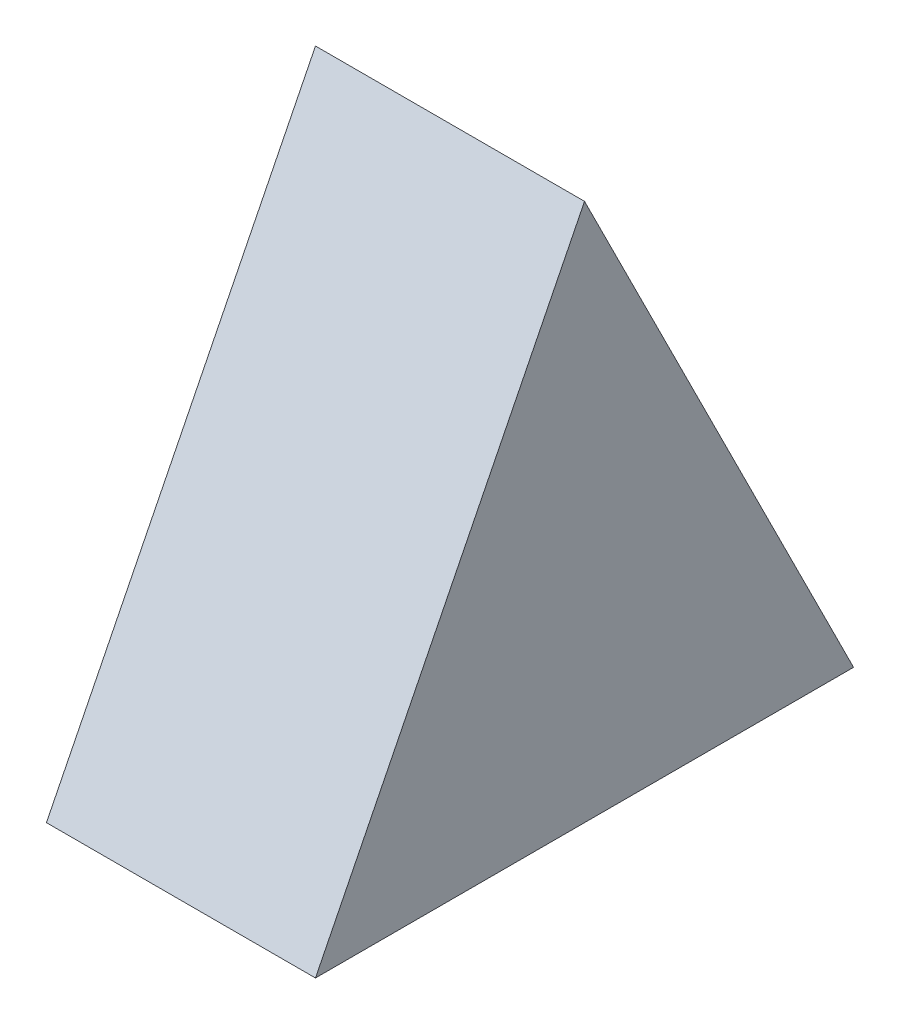
ISO-10303-21;
HEADER;
FILE_DESCRIPTION(('STEP AP214'),'2;1');
FILE_NAME('part.step','',(''),(''),'','','');
FILE_SCHEMA(('AUTOMOTIVE_DESIGN { 1 0 10303 214 1 1 1 1 }'));
ENDSEC;
DATA;
#1=APPLICATION_CONTEXT('core data for automotive mechanical design processes');
#2=APPLICATION_PROTOCOL_DEFINITION('international standard','automotive_design',2000,#1);
#3=PRODUCT_CONTEXT('',#1,'mechanical');
#4=PRODUCT('Part','Part','',(#3));
#5=PRODUCT_RELATED_PRODUCT_CATEGORY('part','',(#4));
#6=PRODUCT_DEFINITION_FORMATION('','',#4);
#7=PRODUCT_DEFINITION_CONTEXT('part definition',#1,'design');
#8=PRODUCT_DEFINITION('design','',#6,#7);
#9=PRODUCT_DEFINITION_SHAPE('','',#8);
#10=(LENGTH_UNIT() NAMED_UNIT(*) SI_UNIT(.MILLI.,.METRE.));
#11=(NAMED_UNIT(*) PLANE_ANGLE_UNIT() SI_UNIT($,.RADIAN.));
#12=(NAMED_UNIT(*) SI_UNIT($,.STERADIAN.) SOLID_ANGLE_UNIT());
#13=UNCERTAINTY_MEASURE_WITH_UNIT(LENGTH_MEASURE(1.E-05),#10,'distance_accuracy_value','');
#14=(GEOMETRIC_REPRESENTATION_CONTEXT(3) GLOBAL_UNCERTAINTY_ASSIGNED_CONTEXT((#13)) GLOBAL_UNIT_ASSIGNED_CONTEXT((#10,
#11,#12)) REPRESENTATION_CONTEXT('',''));
#15=CARTESIAN_POINT('',(0.,0.,0.));
#16=DIRECTION('',(0.,0.,1.));
#17=DIRECTION('',(1.,0.,0.));
#18=AXIS2_PLACEMENT_3D('',#15,#16,#17);
#19=CARTESIAN_POINT('',(0.,0.,40.));
#20=DIRECTION('',(0.,1.,0.));
#21=DIRECTION('',(0.,0.,1.));
#22=AXIS2_PLACEMENT_3D('',#19,#20,#21);
#23=PLANE('',#22);
#24=DIRECTION('',(1.,0.,0.));
#25=VECTOR('',#24,1.);
#26=CARTESIAN_POINT('',(0.,0.,40.));
#27=LINE('',#26,#25);
#28=CARTESIAN_POINT('',(20.,0.,40.));
#29=VERTEX_POINT('',#28);
#30=CARTESIAN_POINT('',(40.,0.,40.));
#31=VERTEX_POINT('',#30);
#32=EDGE_CURVE('E70',#29,#31,#27,.T.);
#33=ORIENTED_EDGE('',*,*,#32,.F.);
#34=DIRECTION('',(0.,0.,1.));
#35=VECTOR('',#34,1.);
#36=CARTESIAN_POINT('',(20.,0.,20.));
#37=LINE('',#36,#35);
#38=CARTESIAN_POINT('',(20.,0.,20.));
#39=VERTEX_POINT('',#38);
#40=EDGE_CURVE('E81',#39,#29,#37,.T.);
#41=ORIENTED_EDGE('',*,*,#40,.F.);
#42=DIRECTION('',(0.707106781186548,0.,0.707106781186548));
#43=VECTOR('',#42,1.);
#44=CARTESIAN_POINT('',(0.,0.,0.));
#45=LINE('',#44,#43);
#46=CARTESIAN_POINT('',(0.,0.,0.));
#47=VERTEX_POINT('',#46);
#48=EDGE_CURVE('E77',#47,#39,#45,.T.);
#49=ORIENTED_EDGE('',*,*,#48,.F.);
#50=DIRECTION('',(1.,0.,0.));
#51=VECTOR('',#50,1.);
#52=CARTESIAN_POINT('',(0.,0.,0.));
#53=LINE('',#52,#51);
#54=CARTESIAN_POINT('',(40.,0.,0.));
#55=VERTEX_POINT('',#54);
#56=EDGE_CURVE('E62',#47,#55,#53,.T.);
#57=ORIENTED_EDGE('',*,*,#56,.T.);
#58=DIRECTION('',(0.,0.,-1.));
#59=VECTOR('',#58,1.);
#60=CARTESIAN_POINT('',(40.,0.,40.));
#61=LINE('',#60,#59);
#62=EDGE_CURVE('E41',#31,#55,#61,.T.);
#63=ORIENTED_EDGE('',*,*,#62,.F.);
#64=EDGE_LOOP('',(#33,#41,#49,#57,#63));
#65=FACE_BOUND('',#64,.T.);
#66=ADVANCED_FACE('F33',(#65),#23,.F.);
#67=CARTESIAN_POINT('',(40.,0.,40.));
#68=DIRECTION('',(-1.,0.,0.));
#69=DIRECTION('',(0.,0.,1.));
#70=AXIS2_PLACEMENT_3D('',#67,#68,#69);
#71=PLANE('',#70);
#72=ORIENTED_EDGE('',*,*,#62,.T.);
#73=DIRECTION('',(0.,0.894427190999916,0.447213595499958));
#74=VECTOR('',#73,1.);
#75=CARTESIAN_POINT('',(40.,0.,0.));
#76=LINE('',#75,#74);
#77=CARTESIAN_POINT('',(40.,40.,20.));
#78=VERTEX_POINT('',#77);
#79=EDGE_CURVE('E65',#55,#78,#76,.T.);
#80=ORIENTED_EDGE('',*,*,#79,.T.);
#81=DIRECTION('',(0.,-0.894427190999916,0.447213595499958));
#82=VECTOR('',#81,1.);
#83=CARTESIAN_POINT('',(40.,0.,40.));
#84=LINE('',#83,#82);
#85=EDGE_CURVE('E82',#78,#31,#84,.T.);
#86=ORIENTED_EDGE('',*,*,#85,.T.);
#87=EDGE_LOOP('',(#72,#80,#86));
#88=FACE_BOUND('',#87,.T.);
#89=ADVANCED_FACE('F92',(#88),#71,.F.);
#90=CARTESIAN_POINT('',(0.,40.,0.));
#91=DIRECTION('',(0.707106781186548,0.,-0.707106781186548));
#92=DIRECTION('',(-0.707106781186548,0.,-0.707106781186548));
#93=AXIS2_PLACEMENT_3D('',#90,#91,#92);
#94=PLANE('',#93);
#95=ORIENTED_EDGE('',*,*,#48,.T.);
#96=DIRECTION('',(0.,-1.,0.));
#97=VECTOR('',#96,1.);
#98=CARTESIAN_POINT('',(20.,40.,20.));
#99=LINE('',#98,#97);
#100=CARTESIAN_POINT('',(20.,40.,20.));
#101=VERTEX_POINT('',#100);
#102=EDGE_CURVE('E71',#101,#39,#99,.T.);
#103=ORIENTED_EDGE('',*,*,#102,.F.);
#104=DIRECTION('',(0.408248290463863,0.816496580927726,0.408248290463863));
#105=VECTOR('',#104,1.);
#106=CARTESIAN_POINT('',(0.,0.,0.));
#107=LINE('',#106,#105);
#108=EDGE_CURVE('E11',#47,#101,#107,.T.);
#109=ORIENTED_EDGE('',*,*,#108,.F.);
#110=EDGE_LOOP('',(#95,#103,#109));
#111=FACE_BOUND('',#110,.T.);
#112=ADVANCED_FACE('F76',(#111),#94,.F.);
#113=CARTESIAN_POINT('',(20.,40.,20.));
#114=DIRECTION('',(1.,0.,0.));
#115=DIRECTION('',(0.,0.,-1.));
#116=AXIS2_PLACEMENT_3D('',#113,#114,#115);
#117=PLANE('',#116);
#118=ORIENTED_EDGE('',*,*,#40,.T.);
#119=DIRECTION('',(0.,-0.894427190999916,0.447213595499958));
#120=VECTOR('',#119,1.);
#121=CARTESIAN_POINT('',(20.,40.,20.));
#122=LINE('',#121,#120);
#123=EDGE_CURVE('E97',#101,#29,#122,.T.);
#124=ORIENTED_EDGE('',*,*,#123,.F.);
#125=ORIENTED_EDGE('',*,*,#102,.T.);
#126=EDGE_LOOP('',(#118,#124,#125));
#127=FACE_BOUND('',#126,.T.);
#128=ADVANCED_FACE('F100',(#127),#117,.F.);
#129=CARTESIAN_POINT('',(60.,40.,20.));
#130=DIRECTION('',(0.,-0.447213595499958,-0.894427190999916));
#131=DIRECTION('',(0.,0.894427190999916,-0.447213595499958));
#132=AXIS2_PLACEMENT_3D('',#129,#130,#131);
#133=PLANE('',#132);
#134=DIRECTION('',(-1.,0.,0.));
#135=VECTOR('',#134,1.);
#136=CARTESIAN_POINT('',(60.,40.,20.));
#137=LINE('',#136,#135);
#138=EDGE_CURVE('E86',#78,#101,#137,.T.);
#139=ORIENTED_EDGE('',*,*,#138,.T.);
#140=ORIENTED_EDGE('',*,*,#123,.T.);
#141=ORIENTED_EDGE('',*,*,#32,.T.);
#142=ORIENTED_EDGE('',*,*,#85,.F.);
#143=EDGE_LOOP('',(#139,#140,#141,#142));
#144=FACE_BOUND('',#143,.T.);
#145=ADVANCED_FACE('F95',(#144),#133,.F.);
#146=CARTESIAN_POINT('',(0.,0.,0.));
#147=DIRECTION('',(0.,-0.447213595499958,0.894427190999916));
#148=DIRECTION('',(0.,-0.894427190999916,-0.447213595499958));
#149=AXIS2_PLACEMENT_3D('',#146,#147,#148);
#150=PLANE('',#149);
#151=ORIENTED_EDGE('',*,*,#108,.T.);
#152=ORIENTED_EDGE('',*,*,#138,.F.);
#153=ORIENTED_EDGE('',*,*,#79,.F.);
#154=ORIENTED_EDGE('',*,*,#56,.F.);
#155=EDGE_LOOP('',(#151,#152,#153,#154));
#156=FACE_BOUND('',#155,.T.);
#157=ADVANCED_FACE('F63',(#156),#150,.F.);
#158=CLOSED_SHELL('',(#66,#89,#112,#128,#145,#157));
#159=MANIFOLD_SOLID_BREP('B2',#158);
#160=ADVANCED_BREP_SHAPE_REPRESENTATION('',(#18,#159),#14);
#161=SHAPE_DEFINITION_REPRESENTATION(#9,#160);
ENDSEC;
END-ISO-10303-21;
